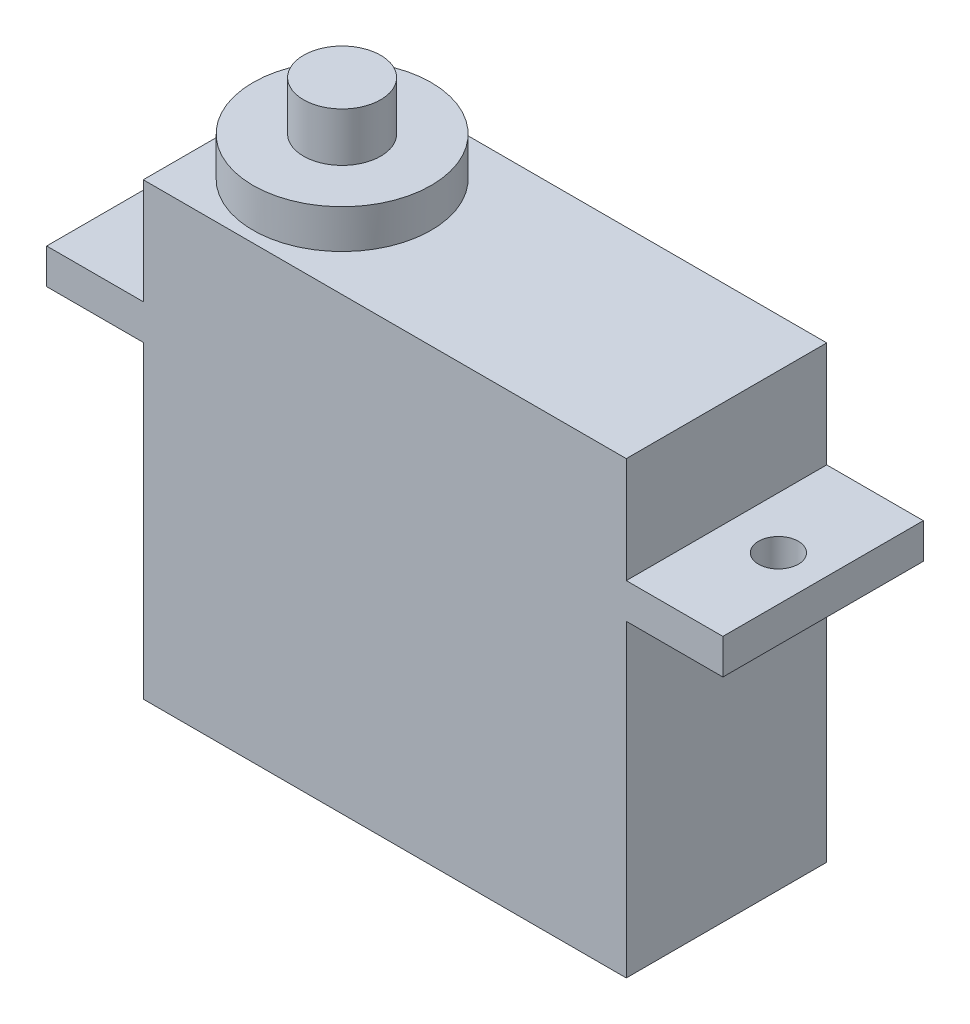
ISO-10303-21;
HEADER;
FILE_DESCRIPTION(('STEP AP214'),'2;1');
FILE_NAME('part.step','',(''),(''),'','','');
FILE_SCHEMA(('AUTOMOTIVE_DESIGN { 1 0 10303 214 1 1 1 1 }'));
ENDSEC;
DATA;
#1=APPLICATION_CONTEXT('core data for automotive mechanical design processes');
#2=APPLICATION_PROTOCOL_DEFINITION('international standard','automotive_design',2000,#1);
#3=PRODUCT_CONTEXT('',#1,'mechanical');
#4=PRODUCT('Part','Part','',(#3));
#5=PRODUCT_RELATED_PRODUCT_CATEGORY('part','',(#4));
#6=PRODUCT_DEFINITION_FORMATION('','',#4);
#7=PRODUCT_DEFINITION_CONTEXT('part definition',#1,'design');
#8=PRODUCT_DEFINITION('design','',#6,#7);
#9=PRODUCT_DEFINITION_SHAPE('','',#8);
#10=(LENGTH_UNIT() NAMED_UNIT(*) SI_UNIT(.MILLI.,.METRE.));
#11=(NAMED_UNIT(*) PLANE_ANGLE_UNIT() SI_UNIT($,.RADIAN.));
#12=(NAMED_UNIT(*) SI_UNIT($,.STERADIAN.) SOLID_ANGLE_UNIT());
#13=UNCERTAINTY_MEASURE_WITH_UNIT(LENGTH_MEASURE(1.E-05),#10,'distance_accuracy_value','');
#14=(GEOMETRIC_REPRESENTATION_CONTEXT(3) GLOBAL_UNCERTAINTY_ASSIGNED_CONTEXT((#13)) GLOBAL_UNIT_ASSIGNED_CONTEXT((#10,
#11,#12)) REPRESENTATION_CONTEXT('',''));
#15=CARTESIAN_POINT('',(0.,0.,0.));
#16=DIRECTION('',(0.,0.,1.));
#17=DIRECTION('',(1.,0.,0.));
#18=AXIS2_PLACEMENT_3D('',#15,#16,#17);
#19=CARTESIAN_POINT('',(0.,8.93,0.));
#20=DIRECTION('',(0.,1.,0.));
#21=DIRECTION('',(0.,0.,1.));
#22=AXIS2_PLACEMENT_3D('',#19,#20,#21);
#23=PLANE('',#22);
#24=CARTESIAN_POINT('',(0.,8.93,0.));
#25=DIRECTION('',(0.,1.,0.));
#26=DIRECTION('',(0.,0.,1.));
#27=AXIS2_PLACEMENT_3D('',#24,#25,#26);
#28=CIRCLE('',#27,4.42938454020618);
#29=CARTESIAN_POINT('',(0.,8.93,4.42938454020618));
#30=VERTEX_POINT('',#29);
#31=EDGE_CURVE('E283',#30,#30,#28,.T.);
#32=ORIENTED_EDGE('',*,*,#31,.T.);
#33=EDGE_LOOP('',(#32));
#34=FACE_BOUND('',#33,.T.);
#35=CARTESIAN_POINT('',(0.,8.93,0.));
#36=DIRECTION('',(0.,1.,0.));
#37=DIRECTION('',(0.,0.,1.));
#38=AXIS2_PLACEMENT_3D('',#35,#36,#37);
#39=CIRCLE('',#38,1.91642915069729);
#40=CARTESIAN_POINT('',(0.,8.93,1.91642915069729));
#41=VERTEX_POINT('',#40);
#42=EDGE_CURVE('E284',#41,#41,#39,.T.);
#43=ORIENTED_EDGE('',*,*,#42,.F.);
#44=EDGE_LOOP('',(#43));
#45=FACE_BOUND('',#44,.T.);
#46=ADVANCED_FACE('F31',(#34,#45),#23,.T.);
#47=CARTESIAN_POINT('',(-4.9,7.,4.98));
#48=DIRECTION('',(0.,-1.,0.));
#49=DIRECTION('',(0.,0.,-1.));
#50=AXIS2_PLACEMENT_3D('',#47,#48,#49);
#51=PLANE('',#50);
#52=DIRECTION('',(-1.,0.,0.));
#53=VECTOR('',#52,1.);
#54=CARTESIAN_POINT('',(-4.9,7.,-4.98));
#55=LINE('',#54,#53);
#56=CARTESIAN_POINT('',(19.1,7.,-4.98));
#57=VERTEX_POINT('',#56);
#58=CARTESIAN_POINT('',(-4.9,7.,-4.98));
#59=VERTEX_POINT('',#58);
#60=EDGE_CURVE('E95',#57,#59,#55,.T.);
#61=ORIENTED_EDGE('',*,*,#60,.T.);
#62=DIRECTION('',(0.,0.,-1.));
#63=VECTOR('',#62,1.);
#64=CARTESIAN_POINT('',(-4.9,7.,4.98));
#65=LINE('',#64,#63);
#66=CARTESIAN_POINT('',(-4.9,7.,4.98));
#67=VERTEX_POINT('',#66);
#68=EDGE_CURVE('E149',#67,#59,#65,.T.);
#69=ORIENTED_EDGE('',*,*,#68,.F.);
#70=DIRECTION('',(-1.,0.,0.));
#71=VECTOR('',#70,1.);
#72=CARTESIAN_POINT('',(-4.9,7.,4.98));
#73=LINE('',#72,#71);
#74=CARTESIAN_POINT('',(19.1,7.,4.98));
#75=VERTEX_POINT('',#74);
#76=EDGE_CURVE('E48',#75,#67,#73,.T.);
#77=ORIENTED_EDGE('',*,*,#76,.F.);
#78=DIRECTION('',(0.,0.,-1.));
#79=VECTOR('',#78,1.);
#80=CARTESIAN_POINT('',(19.1,7.,4.98));
#81=LINE('',#80,#79);
#82=EDGE_CURVE('E145',#75,#57,#81,.T.);
#83=ORIENTED_EDGE('',*,*,#82,.T.);
#84=EDGE_LOOP('',(#61,#69,#77,#83));
#85=FACE_BOUND('',#84,.T.);
#86=CARTESIAN_POINT('',(0.,7.,0.));
#87=DIRECTION('',(0.,-1.,0.));
#88=DIRECTION('',(0.,0.,-1.));
#89=AXIS2_PLACEMENT_3D('',#86,#87,#88);
#90=CIRCLE('',#89,4.42938454020618);
#91=CARTESIAN_POINT('',(0.,7.,-4.42938454020618));
#92=VERTEX_POINT('',#91);
#93=EDGE_CURVE('E11',#92,#92,#90,.F.);
#94=ORIENTED_EDGE('',*,*,#93,.F.);
#95=EDGE_LOOP('',(#94));
#96=FACE_BOUND('',#95,.T.);
#97=ADVANCED_FACE('F245',(#85,#96),#51,.F.);
#98=CARTESIAN_POINT('',(-4.9,7.,4.98));
#99=DIRECTION('',(1.,0.,0.));
#100=DIRECTION('',(0.,0.,-1.));
#101=AXIS2_PLACEMENT_3D('',#98,#99,#100);
#102=PLANE('',#101);
#103=DIRECTION('',(0.,-1.,0.));
#104=VECTOR('',#103,1.);
#105=CARTESIAN_POINT('',(-4.9,7.,-4.98));
#106=LINE('',#105,#104);
#107=CARTESIAN_POINT('',(-4.9,1.75,-4.98));
#108=VERTEX_POINT('',#107);
#109=EDGE_CURVE('E153',#59,#108,#106,.T.);
#110=ORIENTED_EDGE('',*,*,#109,.T.);
#111=DIRECTION('',(0.,0.,-1.));
#112=VECTOR('',#111,1.);
#113=CARTESIAN_POINT('',(-4.9,1.75,4.98));
#114=LINE('',#113,#112);
#115=CARTESIAN_POINT('',(-4.9,1.75,4.98));
#116=VERTEX_POINT('',#115);
#117=EDGE_CURVE('E40',#116,#108,#114,.T.);
#118=ORIENTED_EDGE('',*,*,#117,.F.);
#119=DIRECTION('',(0.,-1.,0.));
#120=VECTOR('',#119,1.);
#121=CARTESIAN_POINT('',(-4.9,7.,4.98));
#122=LINE('',#121,#120);
#123=EDGE_CURVE('E176',#67,#116,#122,.T.);
#124=ORIENTED_EDGE('',*,*,#123,.F.);
#125=ORIENTED_EDGE('',*,*,#68,.T.);
#126=EDGE_LOOP('',(#110,#118,#124,#125));
#127=FACE_BOUND('',#126,.T.);
#128=ADVANCED_FACE('F33',(#127),#102,.F.);
#129=CARTESIAN_POINT('',(-9.7,1.75,4.98));
#130=DIRECTION('',(0.,-1.,0.));
#131=DIRECTION('',(0.,0.,-1.));
#132=AXIS2_PLACEMENT_3D('',#129,#130,#131);
#133=PLANE('',#132);
#134=CARTESIAN_POINT('',(-7.48,1.75,0.));
#135=DIRECTION('',(0.,1.,0.));
#136=DIRECTION('',(0.,0.,1.));
#137=AXIS2_PLACEMENT_3D('',#134,#135,#136);
#138=CIRCLE('',#137,0.99);
#139=CARTESIAN_POINT('',(-7.48,1.75,0.99));
#140=VERTEX_POINT('',#139);
#141=EDGE_CURVE('E202',#140,#140,#138,.T.);
#142=ORIENTED_EDGE('',*,*,#141,.F.);
#143=EDGE_LOOP('',(#142));
#144=FACE_BOUND('',#143,.T.);
#145=DIRECTION('',(-1.,0.,0.));
#146=VECTOR('',#145,1.);
#147=CARTESIAN_POINT('',(-9.7,1.75,-4.98));
#148=LINE('',#147,#146);
#149=CARTESIAN_POINT('',(-9.7,1.75,-4.98));
#150=VERTEX_POINT('',#149);
#151=EDGE_CURVE('E156',#108,#150,#148,.T.);
#152=ORIENTED_EDGE('',*,*,#151,.T.);
#153=DIRECTION('',(0.,0.,-1.));
#154=VECTOR('',#153,1.);
#155=CARTESIAN_POINT('',(-9.7,1.75,4.98));
#156=LINE('',#155,#154);
#157=CARTESIAN_POINT('',(-9.7,1.75,4.98));
#158=VERTEX_POINT('',#157);
#159=EDGE_CURVE('E198',#158,#150,#156,.T.);
#160=ORIENTED_EDGE('',*,*,#159,.F.);
#161=DIRECTION('',(-1.,0.,0.));
#162=VECTOR('',#161,1.);
#163=CARTESIAN_POINT('',(-9.7,1.75,4.98));
#164=LINE('',#163,#162);
#165=EDGE_CURVE('E104',#116,#158,#164,.T.);
#166=ORIENTED_EDGE('',*,*,#165,.F.);
#167=ORIENTED_EDGE('',*,*,#117,.T.);
#168=EDGE_LOOP('',(#152,#160,#166,#167));
#169=FACE_BOUND('',#168,.T.);
#170=ADVANCED_FACE('F322',(#144,#169),#133,.F.);
#171=CARTESIAN_POINT('',(-9.7,1.75,4.98));
#172=DIRECTION('',(1.,0.,0.));
#173=DIRECTION('',(0.,1.,0.));
#174=AXIS2_PLACEMENT_3D('',#171,#172,#173);
#175=PLANE('',#174);
#176=DIRECTION('',(0.,-1.,0.));
#177=VECTOR('',#176,1.);
#178=CARTESIAN_POINT('',(-9.7,1.75,-4.98));
#179=LINE('',#178,#177);
#180=CARTESIAN_POINT('',(-9.7,0.,-4.98));
#181=VERTEX_POINT('',#180);
#182=EDGE_CURVE('E159',#150,#181,#179,.T.);
#183=ORIENTED_EDGE('',*,*,#182,.T.);
#184=DIRECTION('',(0.,0.,-1.));
#185=VECTOR('',#184,1.);
#186=CARTESIAN_POINT('',(-9.7,0.,4.98));
#187=LINE('',#186,#185);
#188=CARTESIAN_POINT('',(-9.7,0.,4.98));
#189=VERTEX_POINT('',#188);
#190=EDGE_CURVE('E195',#189,#181,#187,.T.);
#191=ORIENTED_EDGE('',*,*,#190,.F.);
#192=DIRECTION('',(0.,-1.,0.));
#193=VECTOR('',#192,1.);
#194=CARTESIAN_POINT('',(-9.7,1.75,4.98));
#195=LINE('',#194,#193);
#196=EDGE_CURVE('E217',#158,#189,#195,.T.);
#197=ORIENTED_EDGE('',*,*,#196,.F.);
#198=ORIENTED_EDGE('',*,*,#159,.T.);
#199=EDGE_LOOP('',(#183,#191,#197,#198));
#200=FACE_BOUND('',#199,.T.);
#201=ADVANCED_FACE('F320',(#200),#175,.F.);
#202=CARTESIAN_POINT('',(-9.7,0.,4.98));
#203=DIRECTION('',(0.,1.,0.));
#204=DIRECTION('',(0.,0.,1.));
#205=AXIS2_PLACEMENT_3D('',#202,#203,#204);
#206=PLANE('',#205);
#207=CARTESIAN_POINT('',(-7.48,0.,0.));
#208=DIRECTION('',(0.,1.,0.));
#209=DIRECTION('',(0.,0.,1.));
#210=AXIS2_PLACEMENT_3D('',#207,#208,#209);
#211=CIRCLE('',#210,0.99);
#212=CARTESIAN_POINT('',(-7.48,0.,0.99));
#213=VERTEX_POINT('',#212);
#214=EDGE_CURVE('E157',#213,#213,#211,.T.);
#215=ORIENTED_EDGE('',*,*,#214,.T.);
#216=EDGE_LOOP('',(#215));
#217=FACE_BOUND('',#216,.T.);
#218=DIRECTION('',(1.,0.,0.));
#219=VECTOR('',#218,1.);
#220=CARTESIAN_POINT('',(-9.7,0.,-4.98));
#221=LINE('',#220,#219);
#222=CARTESIAN_POINT('',(-4.9,0.,-4.98));
#223=VERTEX_POINT('',#222);
#224=EDGE_CURVE('E161',#181,#223,#221,.T.);
#225=ORIENTED_EDGE('',*,*,#224,.T.);
#226=DIRECTION('',(0.,0.,-1.));
#227=VECTOR('',#226,1.);
#228=CARTESIAN_POINT('',(-4.9,0.,4.98));
#229=LINE('',#228,#227);
#230=CARTESIAN_POINT('',(-4.9,0.,4.98));
#231=VERTEX_POINT('',#230);
#232=EDGE_CURVE('E192',#231,#223,#229,.T.);
#233=ORIENTED_EDGE('',*,*,#232,.F.);
#234=DIRECTION('',(1.,0.,0.));
#235=VECTOR('',#234,1.);
#236=CARTESIAN_POINT('',(-9.7,0.,4.98));
#237=LINE('',#236,#235);
#238=EDGE_CURVE('E219',#189,#231,#237,.T.);
#239=ORIENTED_EDGE('',*,*,#238,.F.);
#240=ORIENTED_EDGE('',*,*,#190,.T.);
#241=EDGE_LOOP('',(#225,#233,#239,#240));
#242=FACE_BOUND('',#241,.T.);
#243=ADVANCED_FACE('F316',(#217,#242),#206,.F.);
#244=CARTESIAN_POINT('',(-4.9,0.,4.98));
#245=DIRECTION('',(1.,0.,0.));
#246=DIRECTION('',(0.,0.,-1.));
#247=AXIS2_PLACEMENT_3D('',#244,#245,#246);
#248=PLANE('',#247);
#249=DIRECTION('',(0.,-1.,0.));
#250=VECTOR('',#249,1.);
#251=CARTESIAN_POINT('',(-4.9,0.,-4.98));
#252=LINE('',#251,#250);
#253=CARTESIAN_POINT('',(-4.9,-15.35,-4.98));
#254=VERTEX_POINT('',#253);
#255=EDGE_CURVE('E163',#223,#254,#252,.T.);
#256=ORIENTED_EDGE('',*,*,#255,.T.);
#257=DIRECTION('',(0.,0.,-1.));
#258=VECTOR('',#257,1.);
#259=CARTESIAN_POINT('',(-4.9,-15.35,4.98));
#260=LINE('',#259,#258);
#261=CARTESIAN_POINT('',(-4.9,-15.35,4.98));
#262=VERTEX_POINT('',#261);
#263=EDGE_CURVE('E189',#262,#254,#260,.T.);
#264=ORIENTED_EDGE('',*,*,#263,.F.);
#265=DIRECTION('',(0.,-1.,0.));
#266=VECTOR('',#265,1.);
#267=CARTESIAN_POINT('',(-4.9,0.,4.98));
#268=LINE('',#267,#266);
#269=EDGE_CURVE('E221',#231,#262,#268,.T.);
#270=ORIENTED_EDGE('',*,*,#269,.F.);
#271=ORIENTED_EDGE('',*,*,#232,.T.);
#272=EDGE_LOOP('',(#256,#264,#270,#271));
#273=FACE_BOUND('',#272,.T.);
#274=ADVANCED_FACE('F312',(#273),#248,.F.);
#275=CARTESIAN_POINT('',(-4.9,-15.35,4.98));
#276=DIRECTION('',(0.,1.,0.));
#277=DIRECTION('',(0.,0.,1.));
#278=AXIS2_PLACEMENT_3D('',#275,#276,#277);
#279=PLANE('',#278);
#280=DIRECTION('',(1.,0.,0.));
#281=VECTOR('',#280,1.);
#282=CARTESIAN_POINT('',(-4.9,-15.35,-4.98));
#283=LINE('',#282,#281);
#284=CARTESIAN_POINT('',(19.1,-15.35,-4.98));
#285=VERTEX_POINT('',#284);
#286=EDGE_CURVE('E165',#254,#285,#283,.T.);
#287=ORIENTED_EDGE('',*,*,#286,.T.);
#288=DIRECTION('',(0.,0.,-1.));
#289=VECTOR('',#288,1.);
#290=CARTESIAN_POINT('',(19.1,-15.35,4.98));
#291=LINE('',#290,#289);
#292=CARTESIAN_POINT('',(19.1,-15.35,4.98));
#293=VERTEX_POINT('',#292);
#294=EDGE_CURVE('E186',#293,#285,#291,.T.);
#295=ORIENTED_EDGE('',*,*,#294,.F.);
#296=DIRECTION('',(1.,0.,0.));
#297=VECTOR('',#296,1.);
#298=CARTESIAN_POINT('',(-4.9,-15.35,4.98));
#299=LINE('',#298,#297);
#300=EDGE_CURVE('E223',#262,#293,#299,.T.);
#301=ORIENTED_EDGE('',*,*,#300,.F.);
#302=ORIENTED_EDGE('',*,*,#263,.T.);
#303=EDGE_LOOP('',(#287,#295,#301,#302));
#304=FACE_BOUND('',#303,.T.);
#305=ADVANCED_FACE('F308',(#304),#279,.F.);
#306=CARTESIAN_POINT('',(19.1,0.,4.98));
#307=DIRECTION('',(-1.,0.,0.));
#308=DIRECTION('',(0.,0.,1.));
#309=AXIS2_PLACEMENT_3D('',#306,#307,#308);
#310=PLANE('',#309);
#311=DIRECTION('',(0.,1.,0.));
#312=VECTOR('',#311,1.);
#313=CARTESIAN_POINT('',(19.1,0.,-4.98));
#314=LINE('',#313,#312);
#315=CARTESIAN_POINT('',(19.1,0.,-4.98));
#316=VERTEX_POINT('',#315);
#317=EDGE_CURVE('E167',#285,#316,#314,.T.);
#318=ORIENTED_EDGE('',*,*,#317,.T.);
#319=DIRECTION('',(0.,0.,-1.));
#320=VECTOR('',#319,1.);
#321=CARTESIAN_POINT('',(19.1,0.,4.98));
#322=LINE('',#321,#320);
#323=CARTESIAN_POINT('',(19.1,0.,4.98));
#324=VERTEX_POINT('',#323);
#325=EDGE_CURVE('E183',#324,#316,#322,.T.);
#326=ORIENTED_EDGE('',*,*,#325,.F.);
#327=DIRECTION('',(0.,1.,0.));
#328=VECTOR('',#327,1.);
#329=CARTESIAN_POINT('',(19.1,0.,4.98));
#330=LINE('',#329,#328);
#331=EDGE_CURVE('E225',#293,#324,#330,.T.);
#332=ORIENTED_EDGE('',*,*,#331,.F.);
#333=ORIENTED_EDGE('',*,*,#294,.T.);
#334=EDGE_LOOP('',(#318,#326,#332,#333));
#335=FACE_BOUND('',#334,.T.);
#336=ADVANCED_FACE('F304',(#335),#310,.F.);
#337=CARTESIAN_POINT('',(19.1,0.,4.98));
#338=DIRECTION('',(0.,1.,0.));
#339=DIRECTION('',(-1.,0.,0.));
#340=AXIS2_PLACEMENT_3D('',#337,#338,#339);
#341=PLANE('',#340);
#342=CARTESIAN_POINT('',(21.68,0.,0.));
#343=DIRECTION('',(0.,1.,0.));
#344=DIRECTION('',(-1.,0.,0.));
#345=AXIS2_PLACEMENT_3D('',#342,#343,#344);
#346=CIRCLE('',#345,0.990000000000002);
#347=CARTESIAN_POINT('',(20.69,0.,0.));
#348=VERTEX_POINT('',#347);
#349=EDGE_CURVE('E206',#348,#348,#346,.T.);
#350=ORIENTED_EDGE('',*,*,#349,.T.);
#351=EDGE_LOOP('',(#350));
#352=FACE_BOUND('',#351,.T.);
#353=DIRECTION('',(1.,0.,0.));
#354=VECTOR('',#353,1.);
#355=CARTESIAN_POINT('',(19.1,0.,-4.98));
#356=LINE('',#355,#354);
#357=CARTESIAN_POINT('',(23.9,0.,-4.98));
#358=VERTEX_POINT('',#357);
#359=EDGE_CURVE('E169',#316,#358,#356,.T.);
#360=ORIENTED_EDGE('',*,*,#359,.T.);
#361=DIRECTION('',(0.,0.,-1.));
#362=VECTOR('',#361,1.);
#363=CARTESIAN_POINT('',(23.9,0.,4.98));
#364=LINE('',#363,#362);
#365=CARTESIAN_POINT('',(23.9,0.,4.98));
#366=VERTEX_POINT('',#365);
#367=EDGE_CURVE('E180',#366,#358,#364,.T.);
#368=ORIENTED_EDGE('',*,*,#367,.F.);
#369=DIRECTION('',(1.,0.,0.));
#370=VECTOR('',#369,1.);
#371=CARTESIAN_POINT('',(19.1,0.,4.98));
#372=LINE('',#371,#370);
#373=EDGE_CURVE('E227',#324,#366,#372,.T.);
#374=ORIENTED_EDGE('',*,*,#373,.F.);
#375=ORIENTED_EDGE('',*,*,#325,.T.);
#376=EDGE_LOOP('',(#360,#368,#374,#375));
#377=FACE_BOUND('',#376,.T.);
#378=ADVANCED_FACE('F233',(#352,#377),#341,.F.);
#379=CARTESIAN_POINT('',(23.9,1.75,4.98));
#380=DIRECTION('',(-1.,0.,0.));
#381=DIRECTION('',(0.,0.,1.));
#382=AXIS2_PLACEMENT_3D('',#379,#380,#381);
#383=PLANE('',#382);
#384=DIRECTION('',(0.,1.,0.));
#385=VECTOR('',#384,1.);
#386=CARTESIAN_POINT('',(23.9,1.75,-4.98));
#387=LINE('',#386,#385);
#388=CARTESIAN_POINT('',(23.9,1.75,-4.98));
#389=VERTEX_POINT('',#388);
#390=EDGE_CURVE('E171',#358,#389,#387,.T.);
#391=ORIENTED_EDGE('',*,*,#390,.T.);
#392=DIRECTION('',(0.,0.,-1.));
#393=VECTOR('',#392,1.);
#394=CARTESIAN_POINT('',(23.9,1.75,4.98));
#395=LINE('',#394,#393);
#396=CARTESIAN_POINT('',(23.9,1.75,4.98));
#397=VERTEX_POINT('',#396);
#398=EDGE_CURVE('E144',#397,#389,#395,.T.);
#399=ORIENTED_EDGE('',*,*,#398,.F.);
#400=DIRECTION('',(0.,1.,0.));
#401=VECTOR('',#400,1.);
#402=CARTESIAN_POINT('',(23.9,1.75,4.98));
#403=LINE('',#402,#401);
#404=EDGE_CURVE('E135',#366,#397,#403,.T.);
#405=ORIENTED_EDGE('',*,*,#404,.F.);
#406=ORIENTED_EDGE('',*,*,#367,.T.);
#407=EDGE_LOOP('',(#391,#399,#405,#406));
#408=FACE_BOUND('',#407,.T.);
#409=ADVANCED_FACE('F237',(#408),#383,.F.);
#410=CARTESIAN_POINT('',(19.1,1.75,4.98));
#411=DIRECTION('',(0.,-1.,0.));
#412=DIRECTION('',(0.,0.,-1.));
#413=AXIS2_PLACEMENT_3D('',#410,#411,#412);
#414=PLANE('',#413);
#415=CARTESIAN_POINT('',(21.68,1.75,0.));
#416=DIRECTION('',(0.,1.,0.));
#417=DIRECTION('',(0.,0.,1.));
#418=AXIS2_PLACEMENT_3D('',#415,#416,#417);
#419=CIRCLE('',#418,0.990000000000002);
#420=CARTESIAN_POINT('',(21.68,1.75,0.990000000000002));
#421=VERTEX_POINT('',#420);
#422=EDGE_CURVE('E211',#421,#421,#419,.T.);
#423=ORIENTED_EDGE('',*,*,#422,.F.);
#424=EDGE_LOOP('',(#423));
#425=FACE_BOUND('',#424,.T.);
#426=DIRECTION('',(-1.,0.,0.));
#427=VECTOR('',#426,1.);
#428=CARTESIAN_POINT('',(19.1,1.75,-4.98));
#429=LINE('',#428,#427);
#430=CARTESIAN_POINT('',(19.1,1.75,-4.98));
#431=VERTEX_POINT('',#430);
#432=EDGE_CURVE('E143',#389,#431,#429,.T.);
#433=ORIENTED_EDGE('',*,*,#432,.T.);
#434=DIRECTION('',(0.,0.,-1.));
#435=VECTOR('',#434,1.);
#436=CARTESIAN_POINT('',(19.1,1.75,4.98));
#437=LINE('',#436,#435);
#438=CARTESIAN_POINT('',(19.1,1.75,4.98));
#439=VERTEX_POINT('',#438);
#440=EDGE_CURVE('E140',#439,#431,#437,.T.);
#441=ORIENTED_EDGE('',*,*,#440,.F.);
#442=DIRECTION('',(-1.,0.,0.));
#443=VECTOR('',#442,1.);
#444=CARTESIAN_POINT('',(19.1,1.75,4.98));
#445=LINE('',#444,#443);
#446=EDGE_CURVE('E129',#397,#439,#445,.T.);
#447=ORIENTED_EDGE('',*,*,#446,.F.);
#448=ORIENTED_EDGE('',*,*,#398,.T.);
#449=EDGE_LOOP('',(#433,#441,#447,#448));
#450=FACE_BOUND('',#449,.T.);
#451=ADVANCED_FACE('F141',(#425,#450),#414,.F.);
#452=CARTESIAN_POINT('',(19.1,7.,4.98));
#453=DIRECTION('',(-1.,0.,0.));
#454=DIRECTION('',(0.,0.,1.));
#455=AXIS2_PLACEMENT_3D('',#452,#453,#454);
#456=PLANE('',#455);
#457=DIRECTION('',(0.,1.,0.));
#458=VECTOR('',#457,1.);
#459=CARTESIAN_POINT('',(19.1,7.,-4.98));
#460=LINE('',#459,#458);
#461=EDGE_CURVE('E89',#431,#57,#460,.T.);
#462=ORIENTED_EDGE('',*,*,#461,.T.);
#463=ORIENTED_EDGE('',*,*,#82,.F.);
#464=DIRECTION('',(0.,1.,0.));
#465=VECTOR('',#464,1.);
#466=CARTESIAN_POINT('',(19.1,7.,4.98));
#467=LINE('',#466,#465);
#468=EDGE_CURVE('E133',#439,#75,#467,.T.);
#469=ORIENTED_EDGE('',*,*,#468,.F.);
#470=ORIENTED_EDGE('',*,*,#440,.T.);
#471=EDGE_LOOP('',(#462,#463,#469,#470));
#472=FACE_BOUND('',#471,.T.);
#473=ADVANCED_FACE('F147',(#472),#456,.F.);
#474=CARTESIAN_POINT('',(-4.9,1.75,4.98));
#475=DIRECTION('',(0.,0.,1.));
#476=DIRECTION('',(1.,0.,0.));
#477=AXIS2_PLACEMENT_3D('',#474,#475,#476);
#478=PLANE('',#477);
#479=ORIENTED_EDGE('',*,*,#123,.T.);
#480=ORIENTED_EDGE('',*,*,#165,.T.);
#481=ORIENTED_EDGE('',*,*,#196,.T.);
#482=ORIENTED_EDGE('',*,*,#238,.T.);
#483=ORIENTED_EDGE('',*,*,#269,.T.);
#484=ORIENTED_EDGE('',*,*,#300,.T.);
#485=ORIENTED_EDGE('',*,*,#331,.T.);
#486=ORIENTED_EDGE('',*,*,#373,.T.);
#487=ORIENTED_EDGE('',*,*,#404,.T.);
#488=ORIENTED_EDGE('',*,*,#446,.T.);
#489=ORIENTED_EDGE('',*,*,#468,.T.);
#490=ORIENTED_EDGE('',*,*,#76,.T.);
#491=EDGE_LOOP('',(#479,#480,#481,#482,#483,#484,#485,#486,#487,#488,#489,#490));
#492=FACE_BOUND('',#491,.T.);
#493=ADVANCED_FACE('F131',(#492),#478,.T.);
#494=CARTESIAN_POINT('',(-4.9,1.75,-4.98));
#495=DIRECTION('',(0.,0.,1.));
#496=DIRECTION('',(1.,0.,0.));
#497=AXIS2_PLACEMENT_3D('',#494,#495,#496);
#498=PLANE('',#497);
#499=ORIENTED_EDGE('',*,*,#109,.F.);
#500=ORIENTED_EDGE('',*,*,#60,.F.);
#501=ORIENTED_EDGE('',*,*,#461,.F.);
#502=ORIENTED_EDGE('',*,*,#432,.F.);
#503=ORIENTED_EDGE('',*,*,#390,.F.);
#504=ORIENTED_EDGE('',*,*,#359,.F.);
#505=ORIENTED_EDGE('',*,*,#317,.F.);
#506=ORIENTED_EDGE('',*,*,#286,.F.);
#507=ORIENTED_EDGE('',*,*,#255,.F.);
#508=ORIENTED_EDGE('',*,*,#224,.F.);
#509=ORIENTED_EDGE('',*,*,#182,.F.);
#510=ORIENTED_EDGE('',*,*,#151,.F.);
#511=EDGE_LOOP('',(#499,#500,#501,#502,#503,#504,#505,#506,#507,#508,#509,#510));
#512=FACE_BOUND('',#511,.T.);
#513=ADVANCED_FACE('F240',(#512),#498,.F.);
#514=CARTESIAN_POINT('',(-7.48,-15.35,0.));
#515=DIRECTION('',(0.,1.,0.));
#516=DIRECTION('',(0.,0.,1.));
#517=AXIS2_PLACEMENT_3D('',#514,#515,#516);
#518=CYLINDRICAL_SURFACE('',#517,0.99);
#519=ORIENTED_EDGE('',*,*,#141,.T.);
#520=EDGE_LOOP('',(#519));
#521=FACE_BOUND('',#520,.T.);
#522=ORIENTED_EDGE('',*,*,#214,.F.);
#523=EDGE_LOOP('',(#522));
#524=FACE_BOUND('',#523,.T.);
#525=ADVANCED_FACE('F264',(#521,#524),#518,.F.);
#526=CARTESIAN_POINT('',(21.68,-15.35,0.));
#527=DIRECTION('',(0.,1.,0.));
#528=DIRECTION('',(0.,0.,1.));
#529=AXIS2_PLACEMENT_3D('',#526,#527,#528);
#530=CYLINDRICAL_SURFACE('',#529,0.990000000000002);
#531=ORIENTED_EDGE('',*,*,#422,.T.);
#532=EDGE_LOOP('',(#531));
#533=FACE_BOUND('',#532,.T.);
#534=ORIENTED_EDGE('',*,*,#349,.F.);
#535=EDGE_LOOP('',(#534));
#536=FACE_BOUND('',#535,.T.);
#537=ADVANCED_FACE('F254',(#533,#536),#530,.F.);
#538=CARTESIAN_POINT('',(0.,8.93,0.));
#539=DIRECTION('',(0.,-1.,0.));
#540=DIRECTION('',(0.,0.,-1.));
#541=AXIS2_PLACEMENT_3D('',#538,#539,#540);
#542=CYLINDRICAL_SURFACE('',#541,4.42938454020618);
#543=ORIENTED_EDGE('',*,*,#31,.F.);
#544=EDGE_LOOP('',(#543));
#545=FACE_BOUND('',#544,.T.);
#546=ORIENTED_EDGE('',*,*,#93,.T.);
#547=EDGE_LOOP('',(#546));
#548=FACE_BOUND('',#547,.T.);
#549=ADVANCED_FACE('F251',(#545,#548),#542,.T.);
#550=CARTESIAN_POINT('',(0.,11.36,0.));
#551=DIRECTION('',(0.,-1.,0.));
#552=DIRECTION('',(0.,0.,-1.));
#553=AXIS2_PLACEMENT_3D('',#550,#551,#552);
#554=CYLINDRICAL_SURFACE('',#553,1.91642915069729);
#555=CARTESIAN_POINT('',(0.,11.36,0.));
#556=DIRECTION('',(0.,1.,0.));
#557=DIRECTION('',(0.,0.,1.));
#558=AXIS2_PLACEMENT_3D('',#555,#556,#557);
#559=CIRCLE('',#558,1.91642915069729);
#560=CARTESIAN_POINT('',(0.,11.36,1.91642915069729));
#561=VERTEX_POINT('',#560);
#562=EDGE_CURVE('E282',#561,#561,#559,.T.);
#563=ORIENTED_EDGE('',*,*,#562,.F.);
#564=EDGE_LOOP('',(#563));
#565=FACE_BOUND('',#564,.T.);
#566=ORIENTED_EDGE('',*,*,#42,.T.);
#567=EDGE_LOOP('',(#566));
#568=FACE_BOUND('',#567,.T.);
#569=ADVANCED_FACE('F253',(#565,#568),#554,.T.);
#570=CARTESIAN_POINT('',(0.,11.36,0.));
#571=DIRECTION('',(0.,1.,0.));
#572=DIRECTION('',(0.,0.,1.));
#573=AXIS2_PLACEMENT_3D('',#570,#571,#572);
#574=PLANE('',#573);
#575=ORIENTED_EDGE('',*,*,#562,.T.);
#576=EDGE_LOOP('',(#575));
#577=FACE_BOUND('',#576,.T.);
#578=ADVANCED_FACE('F261',(#577),#574,.T.);
#579=CLOSED_SHELL('',(#46,#97,#128,#170,#201,#243,#274,#305,#336,#378,#409,#451,#473,#493,#513,
#525,#537,#549,#569,#578));
#580=MANIFOLD_SOLID_BREP('B2',#579);
#581=ADVANCED_BREP_SHAPE_REPRESENTATION('',(#18,#580),#14);
#582=SHAPE_DEFINITION_REPRESENTATION(#9,#581);
ENDSEC;
END-ISO-10303-21;
